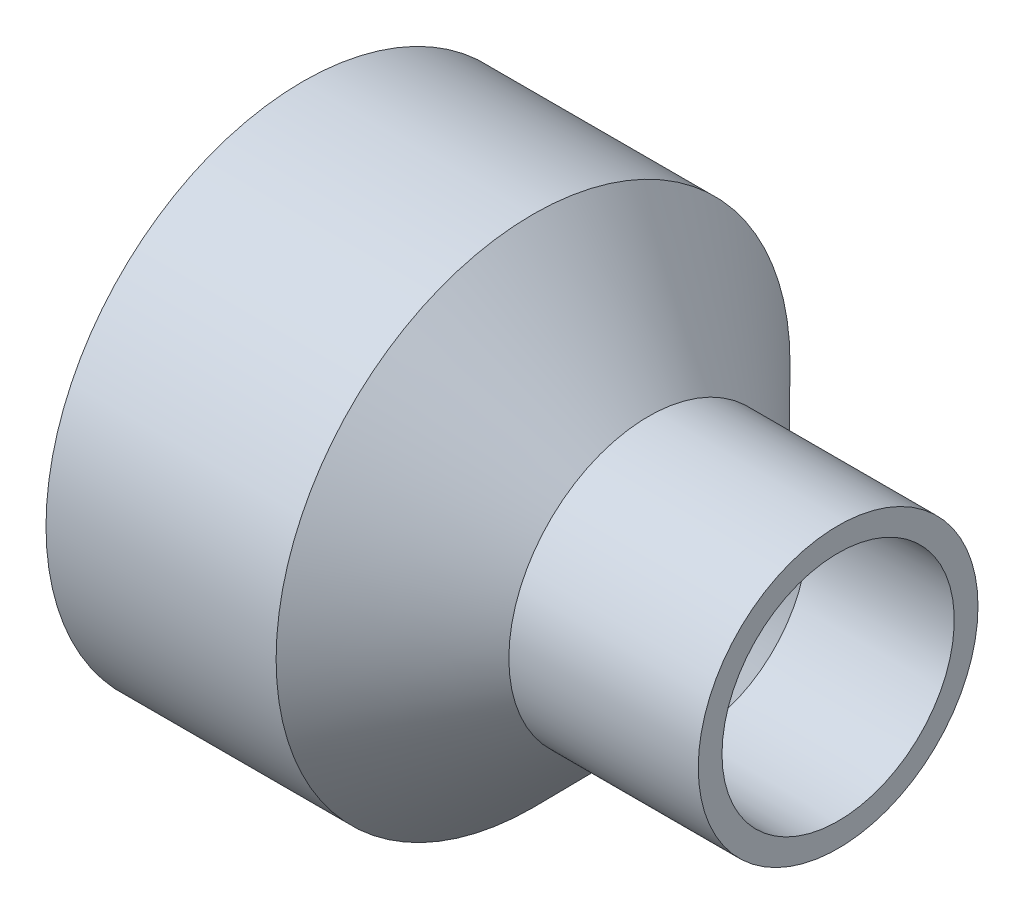
ISO-10303-21;
HEADER;
FILE_DESCRIPTION(('STEP AP214'),'2;1');
FILE_NAME('part.step','',(''),(''),'','','');
FILE_SCHEMA(('AUTOMOTIVE_DESIGN { 1 0 10303 214 1 1 1 1 }'));
ENDSEC;
DATA;
#1=APPLICATION_CONTEXT('core data for automotive mechanical design processes');
#2=APPLICATION_PROTOCOL_DEFINITION('international standard','automotive_design',2000,#1);
#3=PRODUCT_CONTEXT('',#1,'mechanical');
#4=PRODUCT('Part','Part','',(#3));
#5=PRODUCT_RELATED_PRODUCT_CATEGORY('part','',(#4));
#6=PRODUCT_DEFINITION_FORMATION('','',#4);
#7=PRODUCT_DEFINITION_CONTEXT('part definition',#1,'design');
#8=PRODUCT_DEFINITION('design','',#6,#7);
#9=PRODUCT_DEFINITION_SHAPE('','',#8);
#10=(LENGTH_UNIT() NAMED_UNIT(*) SI_UNIT(.MILLI.,.METRE.));
#11=(NAMED_UNIT(*) PLANE_ANGLE_UNIT() SI_UNIT($,.RADIAN.));
#12=(NAMED_UNIT(*) SI_UNIT($,.STERADIAN.) SOLID_ANGLE_UNIT());
#13=UNCERTAINTY_MEASURE_WITH_UNIT(LENGTH_MEASURE(1.E-05),#10,'distance_accuracy_value','');
#14=(GEOMETRIC_REPRESENTATION_CONTEXT(3) GLOBAL_UNCERTAINTY_ASSIGNED_CONTEXT((#13)) GLOBAL_UNIT_ASSIGNED_CONTEXT((#10,
#11,#12)) REPRESENTATION_CONTEXT('',''));
#15=CARTESIAN_POINT('',(0.,0.,0.));
#16=DIRECTION('',(0.,0.,1.));
#17=DIRECTION('',(1.,0.,0.));
#18=AXIS2_PLACEMENT_3D('',#15,#16,#17);
#19=CARTESIAN_POINT('',(-69.85,0.,0.));
#20=DIRECTION('',(-1.,0.,0.));
#21=DIRECTION('',(0.,0.,1.));
#22=AXIS2_PLACEMENT_3D('',#19,#20,#21);
#23=CYLINDRICAL_SURFACE('',#22,67.071875);
#24=CARTESIAN_POINT('',(-9.78282425970729,0.,0.));
#25=DIRECTION('',(-1.,0.,0.));
#26=DIRECTION('',(0.,0.,1.));
#27=AXIS2_PLACEMENT_3D('',#24,#25,#26);
#28=CIRCLE('',#27,67.071875);
#29=CARTESIAN_POINT('',(-9.78282425970729,0.,67.071875));
#30=VERTEX_POINT('',#29);
#31=EDGE_CURVE('E66',#30,#30,#28,.T.);
#32=ORIENTED_EDGE('',*,*,#31,.T.);
#33=EDGE_LOOP('',(#32));
#34=FACE_BOUND('',#33,.T.);
#35=CARTESIAN_POINT('',(-69.85,0.,0.));
#36=DIRECTION('',(-1.,0.,0.));
#37=DIRECTION('',(0.,0.,1.));
#38=AXIS2_PLACEMENT_3D('',#35,#36,#37);
#39=CIRCLE('',#38,67.071875);
#40=CARTESIAN_POINT('',(-69.85,0.,67.071875));
#41=VERTEX_POINT('',#40);
#42=EDGE_CURVE('E10',#41,#41,#39,.T.);
#43=ORIENTED_EDGE('',*,*,#42,.F.);
#44=EDGE_LOOP('',(#43));
#45=FACE_BOUND('',#44,.T.);
#46=ADVANCED_FACE('F32',(#34,#45),#23,.T.);
#47=CARTESIAN_POINT('',(-69.85,-67.071875,0.));
#48=DIRECTION('',(-1.,0.,0.));
#49=DIRECTION('',(0.,0.,1.));
#50=AXIS2_PLACEMENT_3D('',#47,#48,#49);
#51=PLANE('',#50);
#52=ORIENTED_EDGE('',*,*,#42,.T.);
#53=EDGE_LOOP('',(#52));
#54=FACE_BOUND('',#53,.T.);
#55=CARTESIAN_POINT('',(-69.85,0.,0.));
#56=DIRECTION('',(-1.,0.,0.));
#57=DIRECTION('',(0.,0.,1.));
#58=AXIS2_PLACEMENT_3D('',#55,#56,#57);
#59=CIRCLE('',#58,57.3786);
#60=CARTESIAN_POINT('',(-69.85,0.,57.3786));
#61=VERTEX_POINT('',#60);
#62=EDGE_CURVE('E38',#61,#61,#59,.T.);
#63=ORIENTED_EDGE('',*,*,#62,.F.);
#64=EDGE_LOOP('',(#63));
#65=FACE_BOUND('',#64,.T.);
#66=ADVANCED_FACE('F84',(#54,#65),#51,.T.);
#67=CARTESIAN_POINT('',(-13.49375,0.,0.));
#68=DIRECTION('',(-1.,0.,0.));
#69=DIRECTION('',(0.,0.,1.));
#70=AXIS2_PLACEMENT_3D('',#67,#68,#69);
#71=CONICAL_SURFACE('',#70,57.0357,0.006084431958618);
#72=ORIENTED_EDGE('',*,*,#62,.T.);
#73=EDGE_LOOP('',(#72));
#74=FACE_BOUND('',#73,.T.);
#75=CARTESIAN_POINT('',(-13.49375,0.,0.));
#76=DIRECTION('',(-1.,0.,0.));
#77=DIRECTION('',(0.,0.,1.));
#78=AXIS2_PLACEMENT_3D('',#75,#76,#77);
#79=CIRCLE('',#78,57.0357);
#80=CARTESIAN_POINT('',(-13.49375,0.,57.0357));
#81=VERTEX_POINT('',#80);
#82=EDGE_CURVE('E42',#81,#81,#79,.T.);
#83=ORIENTED_EDGE('',*,*,#82,.F.);
#84=EDGE_LOOP('',(#83));
#85=FACE_BOUND('',#84,.T.);
#86=ADVANCED_FACE('F88',(#74,#85),#71,.F.);
#87=CARTESIAN_POINT('',(15.8271591611601,0.,0.));
#88=DIRECTION('',(-1.,0.,0.));
#89=DIRECTION('',(0.,0.,1.));
#90=AXIS2_PLACEMENT_3D('',#87,#88,#89);
#91=CONICAL_SURFACE('',#90,27.3558,0.791482595356068);
#92=ORIENTED_EDGE('',*,*,#82,.T.);
#93=EDGE_LOOP('',(#92));
#94=FACE_BOUND('',#93,.T.);
#95=CARTESIAN_POINT('',(15.8271591611601,0.,0.));
#96=DIRECTION('',(-1.,0.,0.));
#97=DIRECTION('',(0.,0.,1.));
#98=AXIS2_PLACEMENT_3D('',#95,#96,#97);
#99=CIRCLE('',#98,27.3558);
#100=CARTESIAN_POINT('',(15.8271591611601,0.,27.3558));
#101=VERTEX_POINT('',#100);
#102=EDGE_CURVE('E46',#101,#101,#99,.T.);
#103=ORIENTED_EDGE('',*,*,#102,.F.);
#104=EDGE_LOOP('',(#103));
#105=FACE_BOUND('',#104,.T.);
#106=ADVANCED_FACE('F92',(#94,#105),#91,.F.);
#107=CARTESIAN_POINT('',(-69.85,0.,0.));
#108=DIRECTION('',(-1.,0.,0.));
#109=DIRECTION('',(0.,0.,1.));
#110=AXIS2_PLACEMENT_3D('',#107,#108,#109);
#111=CYLINDRICAL_SURFACE('',#110,27.3558);
#112=ORIENTED_EDGE('',*,*,#102,.T.);
#113=EDGE_LOOP('',(#112));
#114=FACE_BOUND('',#113,.T.);
#115=CARTESIAN_POINT('',(28.9860690964743,0.,0.));
#116=DIRECTION('',(-1.,0.,0.));
#117=DIRECTION('',(0.,0.,1.));
#118=AXIS2_PLACEMENT_3D('',#115,#116,#117);
#119=CIRCLE('',#118,27.3558);
#120=CARTESIAN_POINT('',(28.9860690964743,0.,27.3558));
#121=VERTEX_POINT('',#120);
#122=EDGE_CURVE('E51',#121,#121,#119,.T.);
#123=ORIENTED_EDGE('',*,*,#122,.F.);
#124=EDGE_LOOP('',(#123));
#125=FACE_BOUND('',#124,.T.);
#126=ADVANCED_FACE('F98',(#114,#125),#111,.F.);
#127=CARTESIAN_POINT('',(31.75,0.,0.));
#128=DIRECTION('',(1.,0.,0.));
#129=DIRECTION('',(0.,0.,-1.));
#130=AXIS2_PLACEMENT_3D('',#127,#128,#129);
#131=CONICAL_SURFACE('',#130,30.0863,0.779313731438828);
#132=ORIENTED_EDGE('',*,*,#122,.T.);
#133=EDGE_LOOP('',(#132));
#134=FACE_BOUND('',#133,.T.);
#135=CARTESIAN_POINT('',(31.75,0.,0.));
#136=DIRECTION('',(-1.,0.,0.));
#137=DIRECTION('',(0.,0.,1.));
#138=AXIS2_PLACEMENT_3D('',#135,#136,#137);
#139=CIRCLE('',#138,30.0863);
#140=CARTESIAN_POINT('',(31.75,0.,30.0863));
#141=VERTEX_POINT('',#140);
#142=EDGE_CURVE('E54',#141,#141,#139,.T.);
#143=ORIENTED_EDGE('',*,*,#142,.F.);
#144=EDGE_LOOP('',(#143));
#145=FACE_BOUND('',#144,.T.);
#146=ADVANCED_FACE('F102',(#134,#145),#131,.F.);
#147=CARTESIAN_POINT('',(69.85,0.,0.));
#148=DIRECTION('',(1.,0.,0.));
#149=DIRECTION('',(0.,0.,-1.));
#150=AXIS2_PLACEMENT_3D('',#147,#148,#149);
#151=CONICAL_SURFACE('',#150,30.3149,0.00599992800155504);
#152=ORIENTED_EDGE('',*,*,#142,.T.);
#153=EDGE_LOOP('',(#152));
#154=FACE_BOUND('',#153,.T.);
#155=CARTESIAN_POINT('',(69.85,0.,0.));
#156=DIRECTION('',(-1.,0.,0.));
#157=DIRECTION('',(0.,0.,1.));
#158=AXIS2_PLACEMENT_3D('',#155,#156,#157);
#159=CIRCLE('',#158,30.3149);
#160=CARTESIAN_POINT('',(69.85,0.,30.3149));
#161=VERTEX_POINT('',#160);
#162=EDGE_CURVE('E57',#161,#161,#159,.T.);
#163=ORIENTED_EDGE('',*,*,#162,.F.);
#164=EDGE_LOOP('',(#163));
#165=FACE_BOUND('',#164,.T.);
#166=ADVANCED_FACE('F106',(#154,#165),#151,.F.);
#167=CARTESIAN_POINT('',(69.85,-30.3149,0.));
#168=DIRECTION('',(1.,0.,0.));
#169=DIRECTION('',(0.,0.,-1.));
#170=AXIS2_PLACEMENT_3D('',#167,#168,#169);
#171=PLANE('',#170);
#172=ORIENTED_EDGE('',*,*,#162,.T.);
#173=EDGE_LOOP('',(#172));
#174=FACE_BOUND('',#173,.T.);
#175=CARTESIAN_POINT('',(69.85,0.,0.));
#176=DIRECTION('',(-1.,0.,0.));
#177=DIRECTION('',(0.,0.,1.));
#178=AXIS2_PLACEMENT_3D('',#175,#176,#177);
#179=CIRCLE('',#178,36.5125);
#180=CARTESIAN_POINT('',(69.85,0.,36.5125));
#181=VERTEX_POINT('',#180);
#182=EDGE_CURVE('E60',#181,#181,#179,.T.);
#183=ORIENTED_EDGE('',*,*,#182,.F.);
#184=EDGE_LOOP('',(#183));
#185=FACE_BOUND('',#184,.T.);
#186=ADVANCED_FACE('F80',(#174,#185),#171,.T.);
#187=CARTESIAN_POINT('',(-69.85,0.,0.));
#188=DIRECTION('',(-1.,0.,0.));
#189=DIRECTION('',(0.,0.,1.));
#190=AXIS2_PLACEMENT_3D('',#187,#188,#189);
#191=CYLINDRICAL_SURFACE('',#190,36.5125);
#192=ORIENTED_EDGE('',*,*,#182,.T.);
#193=EDGE_LOOP('',(#192));
#194=FACE_BOUND('',#193,.T.);
#195=CARTESIAN_POINT('',(20.4069222824586,0.,0.));
#196=DIRECTION('',(-1.,0.,0.));
#197=DIRECTION('',(0.,0.,1.));
#198=AXIS2_PLACEMENT_3D('',#195,#196,#197);
#199=CIRCLE('',#198,36.5125);
#200=CARTESIAN_POINT('',(20.4069222824586,0.,36.5125));
#201=VERTEX_POINT('',#200);
#202=EDGE_CURVE('E63',#201,#201,#199,.T.);
#203=ORIENTED_EDGE('',*,*,#202,.F.);
#204=EDGE_LOOP('',(#203));
#205=FACE_BOUND('',#204,.T.);
#206=ADVANCED_FACE('F74',(#194,#205),#191,.T.);
#207=CARTESIAN_POINT('',(-9.78282425970729,0.,0.));
#208=DIRECTION('',(-1.,0.,0.));
#209=DIRECTION('',(0.,0.,1.));
#210=AXIS2_PLACEMENT_3D('',#207,#208,#209);
#211=CONICAL_SURFACE('',#210,67.071875,0.791482595356068);
#212=ORIENTED_EDGE('',*,*,#202,.T.);
#213=EDGE_LOOP('',(#212));
#214=FACE_BOUND('',#213,.T.);
#215=ORIENTED_EDGE('',*,*,#31,.F.);
#216=EDGE_LOOP('',(#215));
#217=FACE_BOUND('',#216,.T.);
#218=ADVANCED_FACE('F72',(#214,#217),#211,.T.);
#219=CLOSED_SHELL('',(#46,#66,#86,#106,#126,#146,#166,#186,#206,#218));
#220=MANIFOLD_SOLID_BREP('B2',#219);
#221=ADVANCED_BREP_SHAPE_REPRESENTATION('',(#18,#220),#14);
#222=SHAPE_DEFINITION_REPRESENTATION(#9,#221);
ENDSEC;
END-ISO-10303-21;
